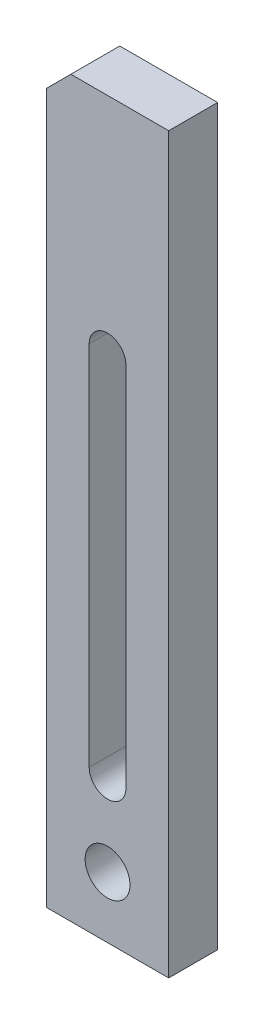
ISO-10303-21;
HEADER;
FILE_DESCRIPTION(('STEP AP214'),'2;1');
FILE_NAME('part.step','',(''),(''),'','','');
FILE_SCHEMA(('AUTOMOTIVE_DESIGN { 1 0 10303 214 1 1 1 1 }'));
ENDSEC;
DATA;
#1=APPLICATION_CONTEXT('core data for automotive mechanical design processes');
#2=APPLICATION_PROTOCOL_DEFINITION('international standard','automotive_design',2000,#1);
#3=PRODUCT_CONTEXT('',#1,'mechanical');
#4=PRODUCT('Part','Part','',(#3));
#5=PRODUCT_RELATED_PRODUCT_CATEGORY('part','',(#4));
#6=PRODUCT_DEFINITION_FORMATION('','',#4);
#7=PRODUCT_DEFINITION_CONTEXT('part definition',#1,'design');
#8=PRODUCT_DEFINITION('design','',#6,#7);
#9=PRODUCT_DEFINITION_SHAPE('','',#8);
#10=(LENGTH_UNIT() NAMED_UNIT(*) SI_UNIT(.MILLI.,.METRE.));
#11=(NAMED_UNIT(*) PLANE_ANGLE_UNIT() SI_UNIT($,.RADIAN.));
#12=(NAMED_UNIT(*) SI_UNIT($,.STERADIAN.) SOLID_ANGLE_UNIT());
#13=UNCERTAINTY_MEASURE_WITH_UNIT(LENGTH_MEASURE(1.E-05),#10,'distance_accuracy_value','');
#14=(GEOMETRIC_REPRESENTATION_CONTEXT(3) GLOBAL_UNCERTAINTY_ASSIGNED_CONTEXT((#13)) GLOBAL_UNIT_ASSIGNED_CONTEXT((#10,
#11,#12)) REPRESENTATION_CONTEXT('',''));
#15=CARTESIAN_POINT('',(0.,0.,0.));
#16=DIRECTION('',(0.,0.,1.));
#17=DIRECTION('',(1.,0.,0.));
#18=AXIS2_PLACEMENT_3D('',#15,#16,#17);
#19=CARTESIAN_POINT('',(15.,90.,12.));
#20=DIRECTION('',(-1.,0.,0.));
#21=DIRECTION('',(0.,-1.,0.));
#22=AXIS2_PLACEMENT_3D('',#19,#20,#21);
#23=PLANE('',#22);
#24=DIRECTION('',(0.,1.,0.));
#25=VECTOR('',#24,1.);
#26=CARTESIAN_POINT('',(15.,90.,0.));
#27=LINE('',#26,#25);
#28=CARTESIAN_POINT('',(15.,-90.,0.));
#29=VERTEX_POINT('',#28);
#30=CARTESIAN_POINT('',(15.,90.,0.));
#31=VERTEX_POINT('',#30);
#32=EDGE_CURVE('E148',#29,#31,#27,.T.);
#33=ORIENTED_EDGE('',*,*,#32,.T.);
#34=DIRECTION('',(0.,0.,-1.));
#35=VECTOR('',#34,1.);
#36=CARTESIAN_POINT('',(15.,90.,12.));
#37=LINE('',#36,#35);
#38=CARTESIAN_POINT('',(15.,90.,12.));
#39=VERTEX_POINT('',#38);
#40=EDGE_CURVE('E180',#39,#31,#37,.T.);
#41=ORIENTED_EDGE('',*,*,#40,.F.);
#42=DIRECTION('',(0.,1.,0.));
#43=VECTOR('',#42,1.);
#44=CARTESIAN_POINT('',(15.,90.,12.));
#45=LINE('',#44,#43);
#46=CARTESIAN_POINT('',(15.,-90.,12.));
#47=VERTEX_POINT('',#46);
#48=EDGE_CURVE('E157',#47,#39,#45,.T.);
#49=ORIENTED_EDGE('',*,*,#48,.F.);
#50=DIRECTION('',(0.,0.,-1.));
#51=VECTOR('',#50,1.);
#52=CARTESIAN_POINT('',(15.,-90.,12.));
#53=LINE('',#52,#51);
#54=EDGE_CURVE('E167',#47,#29,#53,.T.);
#55=ORIENTED_EDGE('',*,*,#54,.T.);
#56=EDGE_LOOP('',(#33,#41,#49,#55));
#57=FACE_BOUND('',#56,.T.);
#58=ADVANCED_FACE('F37',(#57),#23,.F.);
#59=CARTESIAN_POINT('',(-15.,90.,12.));
#60=DIRECTION('',(0.,-1.,0.));
#61=DIRECTION('',(0.,0.,-1.));
#62=AXIS2_PLACEMENT_3D('',#59,#60,#61);
#63=PLANE('',#62);
#64=DIRECTION('',(-1.,0.,0.));
#65=VECTOR('',#64,1.);
#66=CARTESIAN_POINT('',(-15.,90.,0.));
#67=LINE('',#66,#65);
#68=CARTESIAN_POINT('',(-8.99999999999995,90.,0.));
#69=VERTEX_POINT('',#68);
#70=EDGE_CURVE('E170',#31,#69,#67,.T.);
#71=ORIENTED_EDGE('',*,*,#70,.T.);
#72=DIRECTION('',(0.,0.,1.));
#73=VECTOR('',#72,1.);
#74=CARTESIAN_POINT('',(-8.99999999999995,90.,12.));
#75=LINE('',#74,#73);
#76=CARTESIAN_POINT('',(-8.99999999999995,90.,12.));
#77=VERTEX_POINT('',#76);
#78=EDGE_CURVE('E46',#69,#77,#75,.T.);
#79=ORIENTED_EDGE('',*,*,#78,.T.);
#80=DIRECTION('',(-1.,0.,0.));
#81=VECTOR('',#80,1.);
#82=CARTESIAN_POINT('',(-15.,90.,12.));
#83=LINE('',#82,#81);
#84=EDGE_CURVE('E160',#39,#77,#83,.T.);
#85=ORIENTED_EDGE('',*,*,#84,.F.);
#86=ORIENTED_EDGE('',*,*,#40,.T.);
#87=EDGE_LOOP('',(#71,#79,#85,#86));
#88=FACE_BOUND('',#87,.T.);
#89=ADVANCED_FACE('F211',(#88),#63,.F.);
#90=CARTESIAN_POINT('',(-15.,90.,12.));
#91=DIRECTION('',(1.,0.,0.));
#92=DIRECTION('',(0.,1.,0.));
#93=AXIS2_PLACEMENT_3D('',#90,#91,#92);
#94=PLANE('',#93);
#95=DIRECTION('',(0.,-1.,0.));
#96=VECTOR('',#95,1.);
#97=CARTESIAN_POINT('',(-15.,90.,12.));
#98=LINE('',#97,#96);
#99=CARTESIAN_POINT('',(-15.,84.,12.));
#100=VERTEX_POINT('',#99);
#101=CARTESIAN_POINT('',(-15.,-90.,12.));
#102=VERTEX_POINT('',#101);
#103=EDGE_CURVE('E163',#100,#102,#98,.T.);
#104=ORIENTED_EDGE('',*,*,#103,.F.);
#105=DIRECTION('',(0.,0.,-1.));
#106=VECTOR('',#105,1.);
#107=CARTESIAN_POINT('',(-15.,84.,12.));
#108=LINE('',#107,#106);
#109=CARTESIAN_POINT('',(-15.,84.,0.));
#110=VERTEX_POINT('',#109);
#111=EDGE_CURVE('E183',#100,#110,#108,.T.);
#112=ORIENTED_EDGE('',*,*,#111,.T.);
#113=DIRECTION('',(0.,-1.,0.));
#114=VECTOR('',#113,1.);
#115=CARTESIAN_POINT('',(-15.,90.,0.));
#116=LINE('',#115,#114);
#117=CARTESIAN_POINT('',(-15.,-90.,0.));
#118=VERTEX_POINT('',#117);
#119=EDGE_CURVE('E172',#110,#118,#116,.T.);
#120=ORIENTED_EDGE('',*,*,#119,.T.);
#121=DIRECTION('',(0.,0.,-1.));
#122=VECTOR('',#121,1.);
#123=CARTESIAN_POINT('',(-15.,-90.,12.));
#124=LINE('',#123,#122);
#125=EDGE_CURVE('E177',#102,#118,#124,.T.);
#126=ORIENTED_EDGE('',*,*,#125,.F.);
#127=EDGE_LOOP('',(#104,#112,#120,#126));
#128=FACE_BOUND('',#127,.T.);
#129=ADVANCED_FACE('F189',(#128),#94,.F.);
#130=CARTESIAN_POINT('',(-15.,-90.,12.));
#131=DIRECTION('',(0.,1.,0.));
#132=DIRECTION('',(0.,0.,1.));
#133=AXIS2_PLACEMENT_3D('',#130,#131,#132);
#134=PLANE('',#133);
#135=DIRECTION('',(1.,0.,0.));
#136=VECTOR('',#135,1.);
#137=CARTESIAN_POINT('',(-15.,-90.,0.));
#138=LINE('',#137,#136);
#139=EDGE_CURVE('E161',#118,#29,#138,.T.);
#140=ORIENTED_EDGE('',*,*,#139,.T.);
#141=ORIENTED_EDGE('',*,*,#54,.F.);
#142=DIRECTION('',(1.,0.,0.));
#143=VECTOR('',#142,1.);
#144=CARTESIAN_POINT('',(-15.,-90.,12.));
#145=LINE('',#144,#143);
#146=EDGE_CURVE('E165',#102,#47,#145,.T.);
#147=ORIENTED_EDGE('',*,*,#146,.F.);
#148=ORIENTED_EDGE('',*,*,#125,.T.);
#149=EDGE_LOOP('',(#140,#141,#147,#148));
#150=FACE_BOUND('',#149,.T.);
#151=ADVANCED_FACE('F197',(#150),#134,.F.);
#152=CARTESIAN_POINT('',(0.,0.,12.));
#153=DIRECTION('',(0.,0.,1.));
#154=DIRECTION('',(1.,0.,0.));
#155=AXIS2_PLACEMENT_3D('',#152,#153,#154);
#156=PLANE('',#155);
#157=CARTESIAN_POINT('',(0.,35.,12.));
#158=DIRECTION('',(0.,0.,1.));
#159=DIRECTION('',(1.,0.,0.));
#160=AXIS2_PLACEMENT_3D('',#157,#158,#159);
#161=CIRCLE('',#160,4.5);
#162=CARTESIAN_POINT('',(4.49999999999998,35.,12.));
#163=VERTEX_POINT('',#162);
#164=CARTESIAN_POINT('',(-4.50000000000001,35.,12.));
#165=VERTEX_POINT('',#164);
#166=EDGE_CURVE('E114',#163,#165,#161,.T.);
#167=ORIENTED_EDGE('',*,*,#166,.F.);
#168=DIRECTION('',(0.,1.,0.));
#169=VECTOR('',#168,1.);
#170=CARTESIAN_POINT('',(4.49999999999998,35.,12.));
#171=LINE('',#170,#169);
#172=CARTESIAN_POINT('',(4.49999999999999,-55.,12.));
#173=VERTEX_POINT('',#172);
#174=EDGE_CURVE('E132',#173,#163,#171,.T.);
#175=ORIENTED_EDGE('',*,*,#174,.F.);
#176=CARTESIAN_POINT('',(0.,-55.,12.));
#177=DIRECTION('',(0.,0.,1.));
#178=DIRECTION('',(1.,0.,0.));
#179=AXIS2_PLACEMENT_3D('',#176,#177,#178);
#180=CIRCLE('',#179,4.5);
#181=CARTESIAN_POINT('',(-4.5,-55.,12.));
#182=VERTEX_POINT('',#181);
#183=EDGE_CURVE('E135',#182,#173,#180,.T.);
#184=ORIENTED_EDGE('',*,*,#183,.F.);
#185=DIRECTION('',(0.,-1.,0.));
#186=VECTOR('',#185,1.);
#187=CARTESIAN_POINT('',(-4.50000000000001,35.,12.));
#188=LINE('',#187,#186);
#189=EDGE_CURVE('E141',#165,#182,#188,.T.);
#190=ORIENTED_EDGE('',*,*,#189,.F.);
#191=EDGE_LOOP('',(#167,#175,#184,#190));
#192=FACE_BOUND('',#191,.T.);
#193=CARTESIAN_POINT('',(0.,-75.,12.));
#194=DIRECTION('',(0.,0.,1.));
#195=DIRECTION('',(1.,0.,0.));
#196=AXIS2_PLACEMENT_3D('',#193,#194,#195);
#197=CIRCLE('',#196,5.5);
#198=CARTESIAN_POINT('',(5.49999999999999,-75.,12.));
#199=VERTEX_POINT('',#198);
#200=EDGE_CURVE('E154',#199,#199,#197,.T.);
#201=ORIENTED_EDGE('',*,*,#200,.F.);
#202=EDGE_LOOP('',(#201));
#203=FACE_BOUND('',#202,.T.);
#204=ORIENTED_EDGE('',*,*,#84,.T.);
#205=DIRECTION('',(0.707106781186551,0.707106781186544,0.));
#206=VECTOR('',#205,1.);
#207=CARTESIAN_POINT('',(-49.4999999999999,49.5000000000004,12.));
#208=LINE('',#207,#206);
#209=EDGE_CURVE('E11',#77,#100,#208,.F.);
#210=ORIENTED_EDGE('',*,*,#209,.T.);
#211=ORIENTED_EDGE('',*,*,#103,.T.);
#212=ORIENTED_EDGE('',*,*,#146,.T.);
#213=ORIENTED_EDGE('',*,*,#48,.T.);
#214=EDGE_LOOP('',(#204,#210,#211,#212,#213));
#215=FACE_BOUND('',#214,.T.);
#216=ADVANCED_FACE('F203',(#192,#203,#215),#156,.T.);
#217=CARTESIAN_POINT('',(0.,0.,0.));
#218=DIRECTION('',(0.,0.,1.));
#219=DIRECTION('',(1.,0.,0.));
#220=AXIS2_PLACEMENT_3D('',#217,#218,#219);
#221=PLANE('',#220);
#222=DIRECTION('',(0.,1.,0.));
#223=VECTOR('',#222,1.);
#224=CARTESIAN_POINT('',(4.49999999999998,35.,0.));
#225=LINE('',#224,#223);
#226=CARTESIAN_POINT('',(4.49999999999999,-55.,0.));
#227=VERTEX_POINT('',#226);
#228=CARTESIAN_POINT('',(4.49999999999998,35.,0.));
#229=VERTEX_POINT('',#228);
#230=EDGE_CURVE('E119',#227,#229,#225,.T.);
#231=ORIENTED_EDGE('',*,*,#230,.T.);
#232=CARTESIAN_POINT('',(0.,35.,0.));
#233=DIRECTION('',(0.,0.,1.));
#234=DIRECTION('',(1.,0.,0.));
#235=AXIS2_PLACEMENT_3D('',#232,#233,#234);
#236=CIRCLE('',#235,4.5);
#237=CARTESIAN_POINT('',(-4.50000000000001,35.,0.));
#238=VERTEX_POINT('',#237);
#239=EDGE_CURVE('E111',#229,#238,#236,.T.);
#240=ORIENTED_EDGE('',*,*,#239,.T.);
#241=DIRECTION('',(0.,-1.,0.));
#242=VECTOR('',#241,1.);
#243=CARTESIAN_POINT('',(-4.50000000000001,35.,0.));
#244=LINE('',#243,#242);
#245=CARTESIAN_POINT('',(-4.5,-55.,0.));
#246=VERTEX_POINT('',#245);
#247=EDGE_CURVE('E123',#238,#246,#244,.T.);
#248=ORIENTED_EDGE('',*,*,#247,.T.);
#249=CARTESIAN_POINT('',(0.,-55.,0.));
#250=DIRECTION('',(0.,0.,1.));
#251=DIRECTION('',(1.,0.,0.));
#252=AXIS2_PLACEMENT_3D('',#249,#250,#251);
#253=CIRCLE('',#252,4.5);
#254=EDGE_CURVE('E127',#246,#227,#253,.T.);
#255=ORIENTED_EDGE('',*,*,#254,.T.);
#256=EDGE_LOOP('',(#231,#240,#248,#255));
#257=FACE_BOUND('',#256,.T.);
#258=CARTESIAN_POINT('',(0.,-75.,0.));
#259=DIRECTION('',(0.,0.,1.));
#260=DIRECTION('',(1.,0.,0.));
#261=AXIS2_PLACEMENT_3D('',#258,#259,#260);
#262=CIRCLE('',#261,5.5);
#263=CARTESIAN_POINT('',(5.49999999999999,-75.,0.));
#264=VERTEX_POINT('',#263);
#265=EDGE_CURVE('E142',#264,#264,#262,.T.);
#266=ORIENTED_EDGE('',*,*,#265,.T.);
#267=EDGE_LOOP('',(#266));
#268=FACE_BOUND('',#267,.T.);
#269=ORIENTED_EDGE('',*,*,#119,.F.);
#270=DIRECTION('',(-0.707106781186551,-0.707106781186544,0.));
#271=VECTOR('',#270,1.);
#272=CARTESIAN_POINT('',(-15.,84.,0.));
#273=LINE('',#272,#271);
#274=EDGE_CURVE('E60',#110,#69,#273,.F.);
#275=ORIENTED_EDGE('',*,*,#274,.T.);
#276=ORIENTED_EDGE('',*,*,#70,.F.);
#277=ORIENTED_EDGE('',*,*,#32,.F.);
#278=ORIENTED_EDGE('',*,*,#139,.F.);
#279=EDGE_LOOP('',(#269,#275,#276,#277,#278));
#280=FACE_BOUND('',#279,.T.);
#281=ADVANCED_FACE('F129',(#257,#268,#280),#221,.F.);
#282=CARTESIAN_POINT('',(0.,-75.,0.));
#283=DIRECTION('',(0.,0.,1.));
#284=DIRECTION('',(1.,0.,0.));
#285=AXIS2_PLACEMENT_3D('',#282,#283,#284);
#286=CYLINDRICAL_SURFACE('',#285,5.5);
#287=ORIENTED_EDGE('',*,*,#265,.F.);
#288=EDGE_LOOP('',(#287));
#289=FACE_BOUND('',#288,.T.);
#290=ORIENTED_EDGE('',*,*,#200,.T.);
#291=EDGE_LOOP('',(#290));
#292=FACE_BOUND('',#291,.T.);
#293=ADVANCED_FACE('F223',(#289,#292),#286,.F.);
#294=CARTESIAN_POINT('',(0.,35.,0.));
#295=DIRECTION('',(0.,0.,1.));
#296=DIRECTION('',(1.,0.,0.));
#297=AXIS2_PLACEMENT_3D('',#294,#295,#296);
#298=CYLINDRICAL_SURFACE('',#297,4.5);
#299=ORIENTED_EDGE('',*,*,#166,.T.);
#300=DIRECTION('',(0.,0.,1.));
#301=VECTOR('',#300,1.);
#302=CARTESIAN_POINT('',(-4.50000000000001,35.,0.));
#303=LINE('',#302,#301);
#304=EDGE_CURVE('E107',#238,#165,#303,.T.);
#305=ORIENTED_EDGE('',*,*,#304,.F.);
#306=ORIENTED_EDGE('',*,*,#239,.F.);
#307=DIRECTION('',(0.,0.,1.));
#308=VECTOR('',#307,1.);
#309=CARTESIAN_POINT('',(4.49999999999998,35.,0.));
#310=LINE('',#309,#308);
#311=EDGE_CURVE('E146',#229,#163,#310,.T.);
#312=ORIENTED_EDGE('',*,*,#311,.T.);
#313=EDGE_LOOP('',(#299,#305,#306,#312));
#314=FACE_BOUND('',#313,.T.);
#315=ADVANCED_FACE('F109',(#314),#298,.F.);
#316=CARTESIAN_POINT('',(4.49999999999998,35.,0.));
#317=DIRECTION('',(1.,0.,0.));
#318=DIRECTION('',(0.,1.,0.));
#319=AXIS2_PLACEMENT_3D('',#316,#317,#318);
#320=PLANE('',#319);
#321=ORIENTED_EDGE('',*,*,#174,.T.);
#322=ORIENTED_EDGE('',*,*,#311,.F.);
#323=ORIENTED_EDGE('',*,*,#230,.F.);
#324=DIRECTION('',(0.,0.,1.));
#325=VECTOR('',#324,1.);
#326=CARTESIAN_POINT('',(4.49999999999999,-55.,0.));
#327=LINE('',#326,#325);
#328=EDGE_CURVE('E149',#227,#173,#327,.T.);
#329=ORIENTED_EDGE('',*,*,#328,.T.);
#330=EDGE_LOOP('',(#321,#322,#323,#329));
#331=FACE_BOUND('',#330,.T.);
#332=ADVANCED_FACE('F231',(#331),#320,.F.);
#333=CARTESIAN_POINT('',(0.,-55.,0.));
#334=DIRECTION('',(0.,0.,1.));
#335=DIRECTION('',(1.,0.,0.));
#336=AXIS2_PLACEMENT_3D('',#333,#334,#335);
#337=CYLINDRICAL_SURFACE('',#336,4.5);
#338=ORIENTED_EDGE('',*,*,#183,.T.);
#339=ORIENTED_EDGE('',*,*,#328,.F.);
#340=ORIENTED_EDGE('',*,*,#254,.F.);
#341=DIRECTION('',(0.,0.,1.));
#342=VECTOR('',#341,1.);
#343=CARTESIAN_POINT('',(-4.5,-55.,0.));
#344=LINE('',#343,#342);
#345=EDGE_CURVE('E118',#246,#182,#344,.T.);
#346=ORIENTED_EDGE('',*,*,#345,.T.);
#347=EDGE_LOOP('',(#338,#339,#340,#346));
#348=FACE_BOUND('',#347,.T.);
#349=ADVANCED_FACE('F208',(#348),#337,.F.);
#350=CARTESIAN_POINT('',(-4.50000000000001,35.,0.));
#351=DIRECTION('',(-1.,0.,0.));
#352=DIRECTION('',(0.,-1.,0.));
#353=AXIS2_PLACEMENT_3D('',#350,#351,#352);
#354=PLANE('',#353);
#355=ORIENTED_EDGE('',*,*,#189,.T.);
#356=ORIENTED_EDGE('',*,*,#345,.F.);
#357=ORIENTED_EDGE('',*,*,#247,.F.);
#358=ORIENTED_EDGE('',*,*,#304,.T.);
#359=EDGE_LOOP('',(#355,#356,#357,#358));
#360=FACE_BOUND('',#359,.T.);
#361=ADVANCED_FACE('F124',(#360),#354,.F.);
#362=CARTESIAN_POINT('',(-15.,84.,12.));
#363=DIRECTION('',(0.707106781186544,-0.707106781186551,0.));
#364=DIRECTION('',(0.,0.,-1.));
#365=AXIS2_PLACEMENT_3D('',#362,#363,#364);
#366=PLANE('',#365);
#367=ORIENTED_EDGE('',*,*,#209,.F.);
#368=ORIENTED_EDGE('',*,*,#78,.F.);
#369=ORIENTED_EDGE('',*,*,#274,.F.);
#370=ORIENTED_EDGE('',*,*,#111,.F.);
#371=EDGE_LOOP('',(#367,#368,#369,#370));
#372=FACE_BOUND('',#371,.T.);
#373=ADVANCED_FACE('F40',(#372),#366,.F.);
#374=CLOSED_SHELL('',(#58,#89,#129,#151,#216,#281,#293,#315,#332,#349,#361,#373));
#375=MANIFOLD_SOLID_BREP('B2',#374);
#376=ADVANCED_BREP_SHAPE_REPRESENTATION('',(#18,#375),#14);
#377=SHAPE_DEFINITION_REPRESENTATION(#9,#376);
ENDSEC;
END-ISO-10303-21;
